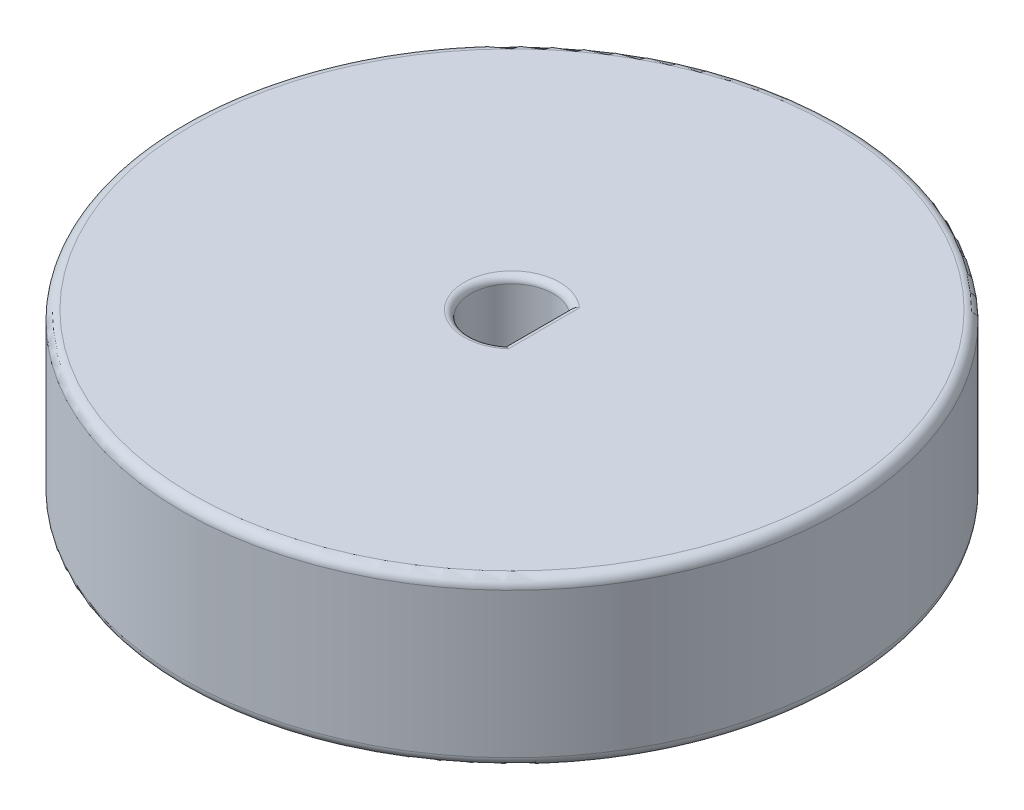
ISO-10303-21;
HEADER;
FILE_DESCRIPTION(('STEP AP214'),'2;1');
FILE_NAME('part.step','',(''),(''),'','','');
FILE_SCHEMA(('AUTOMOTIVE_DESIGN { 1 0 10303 214 1 1 1 1 }'));
ENDSEC;
DATA;
#1=APPLICATION_CONTEXT('core data for automotive mechanical design processes');
#2=APPLICATION_PROTOCOL_DEFINITION('international standard','automotive_design',2000,#1);
#3=PRODUCT_CONTEXT('',#1,'mechanical');
#4=PRODUCT('Part','Part','',(#3));
#5=PRODUCT_RELATED_PRODUCT_CATEGORY('part','',(#4));
#6=PRODUCT_DEFINITION_FORMATION('','',#4);
#7=PRODUCT_DEFINITION_CONTEXT('part definition',#1,'design');
#8=PRODUCT_DEFINITION('design','',#6,#7);
#9=PRODUCT_DEFINITION_SHAPE('','',#8);
#10=(LENGTH_UNIT() NAMED_UNIT(*) SI_UNIT(.MILLI.,.METRE.));
#11=(NAMED_UNIT(*) PLANE_ANGLE_UNIT() SI_UNIT($,.RADIAN.));
#12=(NAMED_UNIT(*) SI_UNIT($,.STERADIAN.) SOLID_ANGLE_UNIT());
#13=UNCERTAINTY_MEASURE_WITH_UNIT(LENGTH_MEASURE(1.E-05),#10,'distance_accuracy_value','');
#14=(GEOMETRIC_REPRESENTATION_CONTEXT(3) GLOBAL_UNCERTAINTY_ASSIGNED_CONTEXT((#13)) GLOBAL_UNIT_ASSIGNED_CONTEXT((#10,
#11,#12)) REPRESENTATION_CONTEXT('',''));
#15=CARTESIAN_POINT('',(0.,0.,0.));
#16=DIRECTION('',(0.,0.,1.));
#17=DIRECTION('',(1.,0.,0.));
#18=AXIS2_PLACEMENT_3D('',#15,#16,#17);
#19=CARTESIAN_POINT('',(0.,6.35,0.));
#20=DIRECTION('',(0.,1.,0.));
#21=DIRECTION('',(0.,0.,1.));
#22=AXIS2_PLACEMENT_3D('',#19,#20,#21);
#23=PLANE('',#22);
#24=CARTESIAN_POINT('',(0.,6.35,0.));
#25=DIRECTION('',(0.,1.,0.));
#26=DIRECTION('',(0.,0.,1.));
#27=AXIS2_PLACEMENT_3D('',#24,#25,#26);
#28=CIRCLE('',#27,12.319);
#29=CARTESIAN_POINT('',(0.,6.35,12.319));
#30=VERTEX_POINT('',#29);
#31=EDGE_CURVE('E11',#30,#30,#28,.T.);
#32=ORIENTED_EDGE('',*,*,#31,.T.);
#33=EDGE_LOOP('',(#32));
#34=FACE_BOUND('',#33,.T.);
#35=CARTESIAN_POINT('',(0.,6.35,0.));
#36=DIRECTION('',(0.,1.,0.));
#37=DIRECTION('',(0.,0.,1.));
#38=AXIS2_PLACEMENT_3D('',#35,#36,#37);
#39=CIRCLE('',#38,1.8415);
#40=CARTESIAN_POINT('',(1.2319,6.35,1.36877486826724));
#41=VERTEX_POINT('',#40);
#42=CARTESIAN_POINT('',(1.2319,6.35,-1.36877486826724));
#43=VERTEX_POINT('',#42);
#44=EDGE_CURVE('E95',#41,#43,#39,.F.);
#45=ORIENTED_EDGE('',*,*,#44,.T.);
#46=DIRECTION('',(0.,0.,-1.));
#47=VECTOR('',#46,1.);
#48=CARTESIAN_POINT('',(1.2319,6.35,0.));
#49=LINE('',#48,#47);
#50=EDGE_CURVE('E84',#43,#41,#49,.F.);
#51=ORIENTED_EDGE('',*,*,#50,.T.);
#52=EDGE_LOOP('',(#45,#51));
#53=FACE_BOUND('',#52,.T.);
#54=ADVANCED_FACE('F33',(#34,#53),#23,.T.);
#55=CARTESIAN_POINT('',(0.,0.,0.));
#56=DIRECTION('',(0.,1.,0.));
#57=DIRECTION('',(0.,0.,1.));
#58=AXIS2_PLACEMENT_3D('',#55,#56,#57);
#59=PLANE('',#58);
#60=CARTESIAN_POINT('',(0.,0.,0.));
#61=DIRECTION('',(0.,1.,0.));
#62=DIRECTION('',(0.,0.,1.));
#63=AXIS2_PLACEMENT_3D('',#60,#61,#62);
#64=CIRCLE('',#63,12.319);
#65=CARTESIAN_POINT('',(0.,0.,12.319));
#66=VERTEX_POINT('',#65);
#67=EDGE_CURVE('E41',#66,#66,#64,.F.);
#68=ORIENTED_EDGE('',*,*,#67,.T.);
#69=EDGE_LOOP('',(#68));
#70=FACE_BOUND('',#69,.T.);
#71=CARTESIAN_POINT('',(0.,0.,0.));
#72=DIRECTION('',(0.,1.,0.));
#73=DIRECTION('',(0.,0.,1.));
#74=AXIS2_PLACEMENT_3D('',#71,#72,#73);
#75=CIRCLE('',#74,1.8415);
#76=CARTESIAN_POINT('',(1.2319,0.,-1.36877486826724));
#77=VERTEX_POINT('',#76);
#78=CARTESIAN_POINT('',(1.2319,0.,1.36877486826724));
#79=VERTEX_POINT('',#78);
#80=EDGE_CURVE('E220',#77,#79,#75,.T.);
#81=ORIENTED_EDGE('',*,*,#80,.T.);
#82=DIRECTION('',(0.,0.,-1.));
#83=VECTOR('',#82,1.);
#84=CARTESIAN_POINT('',(1.2319,0.,-1.25054701630926));
#85=LINE('',#84,#83);
#86=EDGE_CURVE('E221',#79,#77,#85,.T.);
#87=ORIENTED_EDGE('',*,*,#86,.T.);
#88=EDGE_LOOP('',(#81,#87));
#89=FACE_BOUND('',#88,.T.);
#90=ADVANCED_FACE('F125',(#70,#89),#59,.F.);
#91=CARTESIAN_POINT('',(0.,6.35,0.));
#92=DIRECTION('',(0.,-1.,0.));
#93=DIRECTION('',(0.,0.,-1.));
#94=AXIS2_PLACEMENT_3D('',#91,#92,#93);
#95=CYLINDRICAL_SURFACE('',#94,12.7);
#96=CARTESIAN_POINT('',(0.,0.381,0.));
#97=DIRECTION('',(0.,1.,0.));
#98=DIRECTION('',(0.,0.,1.));
#99=AXIS2_PLACEMENT_3D('',#96,#97,#98);
#100=CIRCLE('',#99,12.7);
#101=CARTESIAN_POINT('',(0.,0.381,12.7));
#102=VERTEX_POINT('',#101);
#103=EDGE_CURVE('E244',#102,#102,#100,.T.);
#104=ORIENTED_EDGE('',*,*,#103,.T.);
#105=EDGE_LOOP('',(#104));
#106=FACE_BOUND('',#105,.T.);
#107=CARTESIAN_POINT('',(0.,5.969,0.));
#108=DIRECTION('',(0.,1.,0.));
#109=DIRECTION('',(0.,0.,1.));
#110=AXIS2_PLACEMENT_3D('',#107,#108,#109);
#111=CIRCLE('',#110,12.7);
#112=CARTESIAN_POINT('',(0.,5.969,12.7));
#113=VERTEX_POINT('',#112);
#114=EDGE_CURVE('E217',#113,#113,#111,.F.);
#115=ORIENTED_EDGE('',*,*,#114,.T.);
#116=EDGE_LOOP('',(#115));
#117=FACE_BOUND('',#116,.T.);
#118=ADVANCED_FACE('F121',(#106,#117),#95,.T.);
#119=CARTESIAN_POINT('',(0.,6.35,0.));
#120=DIRECTION('',(0.,-1.,0.));
#121=DIRECTION('',(0.,0.,-1.));
#122=AXIS2_PLACEMENT_3D('',#119,#120,#121);
#123=CYLINDRICAL_SURFACE('',#122,1.5875);
#124=DIRECTION('',(0.,-1.,0.));
#125=VECTOR('',#124,1.);
#126=CARTESIAN_POINT('',(0.9779,6.35,1.25054701630926));
#127=LINE('',#126,#125);
#128=CARTESIAN_POINT('',(0.9779,6.096,1.25054701630926));
#129=VERTEX_POINT('',#128);
#130=CARTESIAN_POINT('',(0.9779,0.254000000000001,1.25054701630926));
#131=VERTEX_POINT('',#130);
#132=EDGE_CURVE('E94',#129,#131,#127,.T.);
#133=ORIENTED_EDGE('',*,*,#132,.T.);
#134=CARTESIAN_POINT('',(0.,0.254,0.));
#135=DIRECTION('',(0.,1.,0.));
#136=DIRECTION('',(0.,0.,1.));
#137=AXIS2_PLACEMENT_3D('',#134,#135,#136);
#138=CIRCLE('',#137,1.5875);
#139=CARTESIAN_POINT('',(0.9779,0.254000000000001,-1.25054701630926));
#140=VERTEX_POINT('',#139);
#141=EDGE_CURVE('E48',#131,#140,#138,.F.);
#142=ORIENTED_EDGE('',*,*,#141,.T.);
#143=DIRECTION('',(0.,-1.,0.));
#144=VECTOR('',#143,1.);
#145=CARTESIAN_POINT('',(0.9779,6.35,-1.25054701630926));
#146=LINE('',#145,#144);
#147=CARTESIAN_POINT('',(0.9779,6.096,-1.25054701630926));
#148=VERTEX_POINT('',#147);
#149=EDGE_CURVE('E93',#148,#140,#146,.T.);
#150=ORIENTED_EDGE('',*,*,#149,.F.);
#151=CARTESIAN_POINT('',(0.,6.096,0.));
#152=DIRECTION('',(0.,1.,0.));
#153=DIRECTION('',(0.,0.,1.));
#154=AXIS2_PLACEMENT_3D('',#151,#152,#153);
#155=CIRCLE('',#154,1.5875);
#156=EDGE_CURVE('E99',#148,#129,#155,.T.);
#157=ORIENTED_EDGE('',*,*,#156,.T.);
#158=EDGE_LOOP('',(#133,#142,#150,#157));
#159=FACE_BOUND('',#158,.T.);
#160=ADVANCED_FACE('F98',(#159),#123,.F.);
#161=CARTESIAN_POINT('',(0.9779,6.35,-1.25054701630926));
#162=DIRECTION('',(-1.,0.,0.));
#163=DIRECTION('',(0.,0.,1.));
#164=AXIS2_PLACEMENT_3D('',#161,#162,#163);
#165=PLANE('',#164);
#166=ORIENTED_EDGE('',*,*,#149,.T.);
#167=DIRECTION('',(0.,0.,-1.));
#168=VECTOR('',#167,1.);
#169=CARTESIAN_POINT('',(0.9779,0.254,1.25054701630926));
#170=LINE('',#169,#168);
#171=EDGE_CURVE('E225',#140,#131,#170,.F.);
#172=ORIENTED_EDGE('',*,*,#171,.T.);
#173=ORIENTED_EDGE('',*,*,#132,.F.);
#174=DIRECTION('',(0.,0.,-1.));
#175=VECTOR('',#174,1.);
#176=CARTESIAN_POINT('',(0.9779,6.096,-1.25054701630926));
#177=LINE('',#176,#175);
#178=EDGE_CURVE('E82',#129,#148,#177,.T.);
#179=ORIENTED_EDGE('',*,*,#178,.T.);
#180=EDGE_LOOP('',(#166,#172,#173,#179));
#181=FACE_BOUND('',#180,.T.);
#182=ADVANCED_FACE('F91',(#181),#165,.T.);
#183=CARTESIAN_POINT('',(0.,6.096,0.));
#184=DIRECTION('',(0.,1.,0.));
#185=DIRECTION('',(0.,0.,1.));
#186=AXIS2_PLACEMENT_3D('',#183,#184,#185);
#187=TOROIDAL_SURFACE('',#186,1.8415,0.254);
#188=ORIENTED_EDGE('',*,*,#156,.F.);
#189=CARTESIAN_POINT('',(0.9779,6.096,-1.25054701630926));
#190=CARTESIAN_POINT('',(0.977884080603557,6.10928090550174,-1.25053810614501));
#191=CARTESIAN_POINT('',(0.978940488010551,6.12254915266806,-1.25105422395971));
#192=CARTESIAN_POINT('',(0.983070348429933,6.14864462029567,-1.25306555426632));
#193=CARTESIAN_POINT('',(0.986136555448044,6.16147325153476,-1.25455724943533));
#194=CARTESIAN_POINT('',(0.994157637178866,6.18636683788161,-1.25844852047631));
#195=CARTESIAN_POINT('',(0.999111380443907,6.19843224544708,-1.26084755245615));
#196=CARTESIAN_POINT('',(1.01070708903987,6.22152557956404,-1.2664415083716));
#197=CARTESIAN_POINT('',(1.01735010257307,6.23255285610648,-1.26963692644493));
#198=CARTESIAN_POINT('',(1.03240940688086,6.25378499794982,-1.27684736477873));
#199=CARTESIAN_POINT('',(1.04088923991329,6.26393473472075,-1.28089152661949));
#200=CARTESIAN_POINT('',(1.0591640962562,6.28268106391838,-1.28955954176142));
#201=CARTESIAN_POINT('',(1.06895955521015,6.29127713965986,-1.29418358704574));
#202=CARTESIAN_POINT('',(1.09058604005826,6.30753334034747,-1.304332301607));
#203=CARTESIAN_POINT('',(1.10252208552118,6.31502630124873,-1.30990080358065));
#204=CARTESIAN_POINT('',(1.12732996272786,6.32789759025871,-1.3213954310607));
#205=CARTESIAN_POINT('',(1.14020224611885,6.33327488963378,-1.32732172893278));
#206=CARTESIAN_POINT('',(1.16555054356811,6.34151510362862,-1.33891090241949));
#207=CARTESIAN_POINT('',(1.17798159129861,6.3445388446409,-1.34455926846858));
#208=CARTESIAN_POINT('',(1.20311348655521,6.34868355852546,-1.35590566894253));
#209=CARTESIAN_POINT('',(1.21581373429699,6.34980838665388,-1.36160357906843));
#210=CARTESIAN_POINT('',(1.2296486033525,6.34999253197791,-1.36777190899068));
#211=CARTESIAN_POINT('',(1.23077431442734,6.35000001787072,-1.36827353350285));
#212=CARTESIAN_POINT('',(1.2319,6.35,-1.36877486826724));
#213=B_SPLINE_CURVE_WITH_KNOTS('',3,(#189,#190,#191,#192,#193,#194,#195,#196,#197,#198,#199,
#200,#201,#202,#203,#204,#205,#206,#207,#208,#209,#210,#211,#212),.UNSPECIFIED.,.F.,.F.,(4,2,2,
2,2,2,2,2,2,2,2,4),(0.,0.0397709786285879,0.0793993525931872,0.119004009358555,
0.158633301272242,0.199952643713171,0.241285702124054,0.286556156693457,0.331848596752017,
0.373677630630865,0.415421638786245,0.419118853904829),.UNSPECIFIED.);
#214=EDGE_CURVE('E78',#148,#43,#213,.T.);
#215=ORIENTED_EDGE('',*,*,#214,.T.);
#216=ORIENTED_EDGE('',*,*,#44,.F.);
#217=CARTESIAN_POINT('',(0.9779,6.096,1.25054701630926));
#218=CARTESIAN_POINT('',(0.977884080603557,6.10928090550174,1.25053810614501));
#219=CARTESIAN_POINT('',(0.978940488010551,6.12254915266806,1.25105422395971));
#220=CARTESIAN_POINT('',(0.983070348429933,6.14864462029567,1.25306555426632));
#221=CARTESIAN_POINT('',(0.986136555448044,6.16147325153476,1.25455724943533));
#222=CARTESIAN_POINT('',(0.994157637178866,6.18636683788161,1.25844852047631));
#223=CARTESIAN_POINT('',(0.999111380443907,6.19843224544708,1.26084755245615));
#224=CARTESIAN_POINT('',(1.01070708903987,6.22152557956404,1.2664415083716));
#225=CARTESIAN_POINT('',(1.01735010257307,6.23255285610648,1.26963692644493));
#226=CARTESIAN_POINT('',(1.03240940688086,6.25378499794982,1.27684736477873));
#227=CARTESIAN_POINT('',(1.04088923991329,6.26393473472075,1.28089152661949));
#228=CARTESIAN_POINT('',(1.0591640962562,6.28268106391838,1.28955954176142));
#229=CARTESIAN_POINT('',(1.06895955521015,6.29127713965986,1.29418358704574));
#230=CARTESIAN_POINT('',(1.09058604005826,6.30753334034747,1.304332301607));
#231=CARTESIAN_POINT('',(1.10252208552118,6.31502630124873,1.30990080358065));
#232=CARTESIAN_POINT('',(1.12732996272786,6.32789759025871,1.3213954310607));
#233=CARTESIAN_POINT('',(1.14020224611885,6.33327488963378,1.32732172893278));
#234=CARTESIAN_POINT('',(1.16555054356811,6.34151510362862,1.33891090241949));
#235=CARTESIAN_POINT('',(1.17798159129861,6.3445388446409,1.34455926846858));
#236=CARTESIAN_POINT('',(1.20311348655521,6.34868355852546,1.35590566894253));
#237=CARTESIAN_POINT('',(1.21581373429699,6.34980838665388,1.36160357906843));
#238=CARTESIAN_POINT('',(1.2296486033525,6.34999253197791,1.36777190899068));
#239=CARTESIAN_POINT('',(1.23077431442734,6.35000001787072,1.36827353350285));
#240=CARTESIAN_POINT('',(1.2319,6.35,1.36877486826724));
#241=B_SPLINE_CURVE_WITH_KNOTS('',3,(#217,#218,#219,#220,#221,#222,#223,#224,#225,#226,#227,
#228,#229,#230,#231,#232,#233,#234,#235,#236,#237,#238,#239,#240),.UNSPECIFIED.,.F.,.F.,(4,2,2,
2,2,2,2,2,2,2,2,4),(0.,0.0397709786285879,0.0793993525931872,0.119004009358555,
0.158633301272242,0.199952643713171,0.241285702124054,0.286556156693457,0.331848596752017,
0.373677630630865,0.415421638786245,0.419118853904829),.UNSPECIFIED.);
#242=EDGE_CURVE('E87',#41,#129,#241,.F.);
#243=ORIENTED_EDGE('',*,*,#242,.T.);
#244=EDGE_LOOP('',(#188,#215,#216,#243));
#245=FACE_BOUND('',#244,.T.);
#246=ADVANCED_FACE('F101',(#245),#187,.T.);
#247=CARTESIAN_POINT('',(1.2319,6.096,-1.25054701630926));
#248=DIRECTION('',(0.,0.,-1.));
#249=DIRECTION('',(-1.,0.,0.));
#250=AXIS2_PLACEMENT_3D('',#247,#248,#249);
#251=CYLINDRICAL_SURFACE('',#250,0.254);
#252=ORIENTED_EDGE('',*,*,#242,.F.);
#253=ORIENTED_EDGE('',*,*,#50,.F.);
#254=ORIENTED_EDGE('',*,*,#214,.F.);
#255=ORIENTED_EDGE('',*,*,#178,.F.);
#256=EDGE_LOOP('',(#252,#253,#254,#255));
#257=FACE_BOUND('',#256,.T.);
#258=ADVANCED_FACE('F81',(#257),#251,.T.);
#259=CARTESIAN_POINT('',(0.,0.254,0.));
#260=DIRECTION('',(0.,1.,0.));
#261=DIRECTION('',(0.,0.,1.));
#262=AXIS2_PLACEMENT_3D('',#259,#260,#261);
#263=TOROIDAL_SURFACE('',#262,1.8415,0.254);
#264=CARTESIAN_POINT('',(0.9779,0.254000000000001,-1.25054701630926));
#265=CARTESIAN_POINT('',(0.977884080603556,0.240719094498265,-1.25053810614501));
#266=CARTESIAN_POINT('',(0.978940488010551,0.227450847331939,-1.25105422395971));
#267=CARTESIAN_POINT('',(0.983070348429933,0.201355379704328,-1.25306555426632));
#268=CARTESIAN_POINT('',(0.986136555448044,0.188526748465244,-1.25455724943532));
#269=CARTESIAN_POINT('',(0.994157637178866,0.163633162118387,-1.25844852047631));
#270=CARTESIAN_POINT('',(0.999111380443907,0.15156775455292,-1.26084755245614));
#271=CARTESIAN_POINT('',(1.01070708903987,0.128474420435959,-1.2664415083716));
#272=CARTESIAN_POINT('',(1.01735010257307,0.117447143893522,-1.26963692644492));
#273=CARTESIAN_POINT('',(1.03240940688086,0.0962150020501849,-1.27684736477873));
#274=CARTESIAN_POINT('',(1.04088923991329,0.0860652652792535,-1.28089152661949));
#275=CARTESIAN_POINT('',(1.0591640962562,0.0673189360816248,-1.28955954176142));
#276=CARTESIAN_POINT('',(1.06895955521015,0.0587228603401375,-1.29418358704574));
#277=CARTESIAN_POINT('',(1.09058604005826,0.04246665965253,-1.304332301607));
#278=CARTESIAN_POINT('',(1.10252208552118,0.0349736987512712,-1.30990080358065));
#279=CARTESIAN_POINT('',(1.12732996272786,0.022102409741291,-1.3213954310607));
#280=CARTESIAN_POINT('',(1.14020224611885,0.0167251103662242,-1.32732172893278));
#281=CARTESIAN_POINT('',(1.16555054356811,0.00848489637137629,-1.3389109024195));
#282=CARTESIAN_POINT('',(1.1779815912986,0.00546115535909404,-1.34455926846859));
#283=CARTESIAN_POINT('',(1.20311348655522,0.00131644147454267,-1.35590566894252));
#284=CARTESIAN_POINT('',(1.21581373429701,0.000191613346124444,-1.36160357906839));
#285=CARTESIAN_POINT('',(1.2296486033525,7.46802209189337E-06,-1.36777190899067));
#286=CARTESIAN_POINT('',(1.23077431442734,-1.78707187900619E-08,-1.36827353350285));
#287=CARTESIAN_POINT('',(1.2319,0.,-1.36877486826724));
#288=B_SPLINE_CURVE_WITH_KNOTS('',3,(#264,#265,#266,#267,#268,#269,#270,#271,#272,#273,#274,
#275,#276,#277,#278,#279,#280,#281,#282,#283,#284,#285,#286,#287),.UNSPECIFIED.,.F.,.F.,(4,2,2,
2,2,2,2,2,2,2,2,4),(0.,0.0397709786285885,0.0793993525931877,0.119004009358555,
0.158633301272242,0.19995264371317,0.241285702124054,0.286556156693459,0.331848596752017,
0.373677630630865,0.415421638786246,0.41911885390483),.UNSPECIFIED.);
#289=EDGE_CURVE('E230',#140,#77,#288,.T.);
#290=ORIENTED_EDGE('',*,*,#289,.F.);
#291=ORIENTED_EDGE('',*,*,#141,.F.);
#292=CARTESIAN_POINT('',(0.9779,0.254000000000001,1.25054701630926));
#293=CARTESIAN_POINT('',(0.977884080603556,0.240719094498265,1.25053810614501));
#294=CARTESIAN_POINT('',(0.978940488010551,0.227450847331939,1.25105422395971));
#295=CARTESIAN_POINT('',(0.983070348429933,0.201355379704328,1.25306555426632));
#296=CARTESIAN_POINT('',(0.986136555448044,0.188526748465244,1.25455724943532));
#297=CARTESIAN_POINT('',(0.994157637178866,0.163633162118387,1.25844852047631));
#298=CARTESIAN_POINT('',(0.999111380443907,0.15156775455292,1.26084755245614));
#299=CARTESIAN_POINT('',(1.01070708903987,0.128474420435959,1.2664415083716));
#300=CARTESIAN_POINT('',(1.01735010257307,0.117447143893522,1.26963692644492));
#301=CARTESIAN_POINT('',(1.03240940688086,0.0962150020501849,1.27684736477873));
#302=CARTESIAN_POINT('',(1.04088923991329,0.0860652652792535,1.28089152661949));
#303=CARTESIAN_POINT('',(1.0591640962562,0.0673189360816248,1.28955954176142));
#304=CARTESIAN_POINT('',(1.06895955521015,0.0587228603401375,1.29418358704574));
#305=CARTESIAN_POINT('',(1.09058604005826,0.04246665965253,1.304332301607));
#306=CARTESIAN_POINT('',(1.10252208552118,0.0349736987512712,1.30990080358065));
#307=CARTESIAN_POINT('',(1.12732996272786,0.022102409741291,1.3213954310607));
#308=CARTESIAN_POINT('',(1.14020224611885,0.0167251103662242,1.32732172893278));
#309=CARTESIAN_POINT('',(1.16555054356811,0.00848489637137629,1.3389109024195));
#310=CARTESIAN_POINT('',(1.1779815912986,0.00546115535909404,1.34455926846859));
#311=CARTESIAN_POINT('',(1.20311348655522,0.00131644147454267,1.35590566894252));
#312=CARTESIAN_POINT('',(1.21581373429701,0.000191613346124444,1.36160357906839));
#313=CARTESIAN_POINT('',(1.2296486033525,7.46802209189337E-06,1.36777190899067));
#314=CARTESIAN_POINT('',(1.23077431442734,-1.78707187900619E-08,1.36827353350285));
#315=CARTESIAN_POINT('',(1.2319,0.,1.36877486826724));
#316=B_SPLINE_CURVE_WITH_KNOTS('',3,(#292,#293,#294,#295,#296,#297,#298,#299,#300,#301,#302,
#303,#304,#305,#306,#307,#308,#309,#310,#311,#312,#313,#314,#315),.UNSPECIFIED.,.F.,.F.,(4,2,2,
2,2,2,2,2,2,2,2,4),(0.,0.0397709786285885,0.0793993525931877,0.119004009358555,
0.158633301272242,0.19995264371317,0.241285702124054,0.286556156693459,0.331848596752017,
0.373677630630865,0.415421638786246,0.41911885390483),.UNSPECIFIED.);
#317=EDGE_CURVE('E56',#79,#131,#316,.F.);
#318=ORIENTED_EDGE('',*,*,#317,.F.);
#319=ORIENTED_EDGE('',*,*,#80,.F.);
#320=EDGE_LOOP('',(#290,#291,#318,#319));
#321=FACE_BOUND('',#320,.T.);
#322=ADVANCED_FACE('F151',(#321),#263,.T.);
#323=CARTESIAN_POINT('',(1.2319,0.254,0.));
#324=DIRECTION('',(0.,0.,1.));
#325=DIRECTION('',(1.,0.,0.));
#326=AXIS2_PLACEMENT_3D('',#323,#324,#325);
#327=CYLINDRICAL_SURFACE('',#326,0.254);
#328=ORIENTED_EDGE('',*,*,#317,.T.);
#329=ORIENTED_EDGE('',*,*,#171,.F.);
#330=ORIENTED_EDGE('',*,*,#289,.T.);
#331=ORIENTED_EDGE('',*,*,#86,.F.);
#332=EDGE_LOOP('',(#328,#329,#330,#331));
#333=FACE_BOUND('',#332,.T.);
#334=ADVANCED_FACE('F156',(#333),#327,.T.);
#335=CARTESIAN_POINT('',(0.,0.381,0.));
#336=DIRECTION('',(0.,1.,0.));
#337=DIRECTION('',(0.,0.,1.));
#338=AXIS2_PLACEMENT_3D('',#335,#336,#337);
#339=TOROIDAL_SURFACE('',#338,12.319,0.381);
#340=ORIENTED_EDGE('',*,*,#67,.F.);
#341=EDGE_LOOP('',(#340));
#342=FACE_BOUND('',#341,.T.);
#343=ORIENTED_EDGE('',*,*,#103,.F.);
#344=EDGE_LOOP('',(#343));
#345=FACE_BOUND('',#344,.T.);
#346=ADVANCED_FACE('F163',(#342,#345),#339,.T.);
#347=CARTESIAN_POINT('',(0.,5.969,0.));
#348=DIRECTION('',(0.,1.,0.));
#349=DIRECTION('',(0.,0.,1.));
#350=AXIS2_PLACEMENT_3D('',#347,#348,#349);
#351=TOROIDAL_SURFACE('',#350,12.319,0.381);
#352=ORIENTED_EDGE('',*,*,#114,.F.);
#353=EDGE_LOOP('',(#352));
#354=FACE_BOUND('',#353,.T.);
#355=ORIENTED_EDGE('',*,*,#31,.F.);
#356=EDGE_LOOP('',(#355));
#357=FACE_BOUND('',#356,.T.);
#358=ADVANCED_FACE('F35',(#354,#357),#351,.T.);
#359=CLOSED_SHELL('',(#54,#90,#118,#160,#182,#246,#258,#322,#334,#346,#358));
#360=MANIFOLD_SOLID_BREP('B2',#359);
#361=ADVANCED_BREP_SHAPE_REPRESENTATION('',(#18,#360),#14);
#362=SHAPE_DEFINITION_REPRESENTATION(#9,#361);
ENDSEC;
END-ISO-10303-21;
